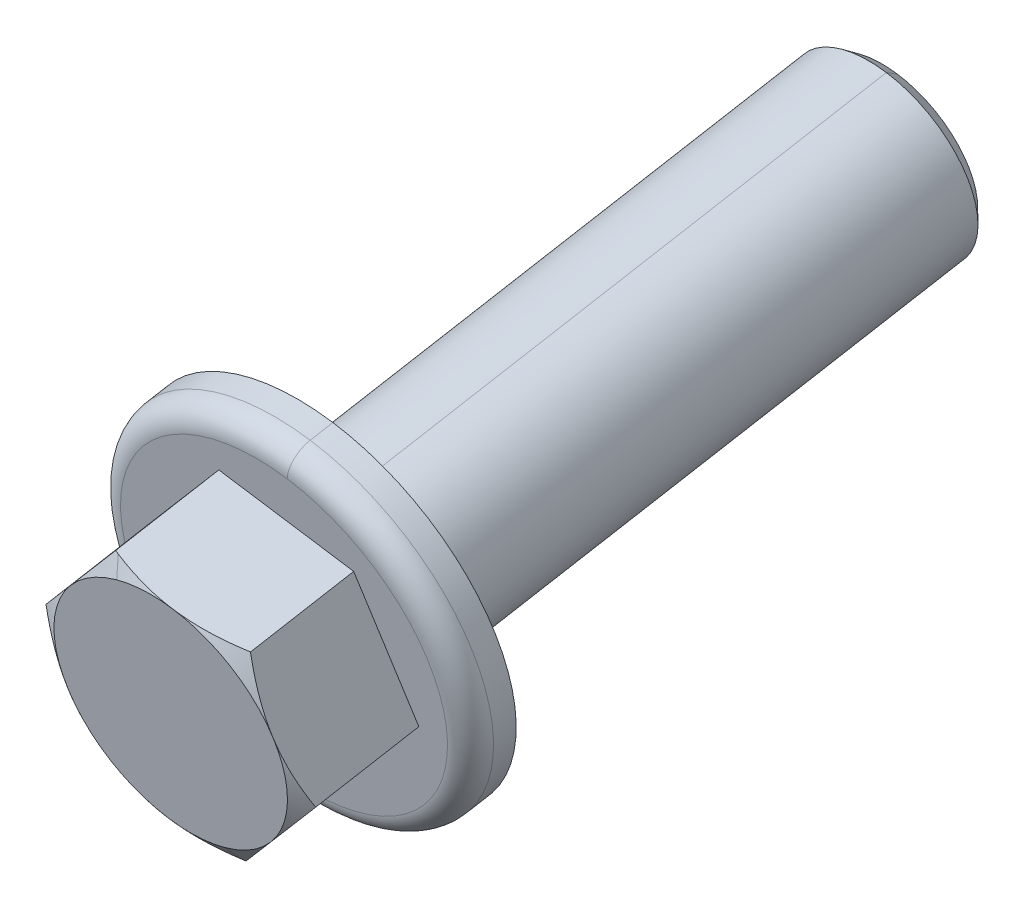
ISO-10303-21;
HEADER;
FILE_DESCRIPTION(('STEP AP214'),'2;1');
FILE_NAME('part.step','',(''),(''),'','','');
FILE_SCHEMA(('AUTOMOTIVE_DESIGN { 1 0 10303 214 1 1 1 1 }'));
ENDSEC;
DATA;
#1=APPLICATION_CONTEXT('core data for automotive mechanical design processes');
#2=APPLICATION_PROTOCOL_DEFINITION('international standard','automotive_design',2000,#1);
#3=PRODUCT_CONTEXT('',#1,'mechanical');
#4=PRODUCT('Part','Part','',(#3));
#5=PRODUCT_RELATED_PRODUCT_CATEGORY('part','',(#4));
#6=PRODUCT_DEFINITION_FORMATION('','',#4);
#7=PRODUCT_DEFINITION_CONTEXT('part definition',#1,'design');
#8=PRODUCT_DEFINITION('design','',#6,#7);
#9=PRODUCT_DEFINITION_SHAPE('','',#8);
#10=(LENGTH_UNIT() NAMED_UNIT(*) SI_UNIT(.MILLI.,.METRE.));
#11=(NAMED_UNIT(*) PLANE_ANGLE_UNIT() SI_UNIT($,.RADIAN.));
#12=(NAMED_UNIT(*) SI_UNIT($,.STERADIAN.) SOLID_ANGLE_UNIT());
#13=UNCERTAINTY_MEASURE_WITH_UNIT(LENGTH_MEASURE(1.E-05),#10,'distance_accuracy_value','');
#14=(GEOMETRIC_REPRESENTATION_CONTEXT(3) GLOBAL_UNCERTAINTY_ASSIGNED_CONTEXT((#13)) GLOBAL_UNIT_ASSIGNED_CONTEXT((#10,
#11,#12)) REPRESENTATION_CONTEXT('',''));
#15=CARTESIAN_POINT('',(0.,0.,0.));
#16=DIRECTION('',(0.,0.,1.));
#17=DIRECTION('',(1.,0.,0.));
#18=AXIS2_PLACEMENT_3D('',#15,#16,#17);
#19=CARTESIAN_POINT('',(50.8182230138327,136.292512906333,22.8581244768172));
#20=DIRECTION('',(0.,-0.173648177667837,0.984807753012048));
#21=DIRECTION('',(-0.981823816584318,0.186911201339512,0.0329574877929656));
#22=AXIS2_PLACEMENT_3D('',#19,#20,#21);
#23=TOROIDAL_SURFACE('',#22,4.25,0.25);
#24=CARTESIAN_POINT('',(50.8182230138327,136.249100861916,23.1043264150702));
#25=DIRECTION('',(0.,0.173648177667837,-0.984807753012048));
#26=DIRECTION('',(0.981823816584318,-0.186911201339512,-0.0329574877929656));
#27=AXIS2_PLACEMENT_3D('',#24,#25,#26);
#28=CIRCLE('',#27,4.25);
#29=CARTESIAN_POINT('',(51.6248500974065,140.358458615238,23.8289170603684));
#30=VERTEX_POINT('',#29);
#31=CARTESIAN_POINT('',(50.011595930259,132.139743108593,22.379735769772));
#32=VERTEX_POINT('',#31);
#33=EDGE_CURVE('E11',#30,#32,#28,.T.);
#34=ORIENTED_EDGE('',*,*,#33,.T.);
#35=CARTESIAN_POINT('',(50.011595930259,132.18315515301,22.133533831519));
#36=DIRECTION('',(-0.981823816584318,0.186911201339513,0.0329574877929657));
#37=DIRECTION('',(0.,-0.173648177667851,0.984807753012046));
#38=AXIS2_PLACEMENT_3D('',#35,#36,#37);
#39=CIRCLE('',#38,0.25);
#40=CARTESIAN_POINT('',(50.0590445822339,132.424882079676,22.1761568106542));
#41=VERTEX_POINT('',#40);
#42=EDGE_CURVE('E33',#32,#41,#39,.T.);
#43=ORIENTED_EDGE('',*,*,#42,.T.);
#44=CARTESIAN_POINT('',(50.8182230138327,136.292512906333,22.8581244768172));
#45=DIRECTION('',(0.,0.173648177667837,-0.984807753012048));
#46=DIRECTION('',(0.981823816584318,-0.186911201339512,-0.0329574877929656));
#47=AXIS2_PLACEMENT_3D('',#44,#45,#46);
#48=CIRCLE('',#47,4.);
#49=CARTESIAN_POINT('',(51.5774014454315,140.160143732989,23.5400921429802));
#50=VERTEX_POINT('',#49);
#51=EDGE_CURVE('E461',#50,#41,#48,.T.);
#52=ORIENTED_EDGE('',*,*,#51,.F.);
#53=CARTESIAN_POINT('',(51.6248500974065,140.401870659655,23.5827151221153));
#54=DIRECTION('',(0.981823816584318,-0.186911201339512,-0.0329574877929657));
#55=DIRECTION('',(0.,-0.173648177667851,0.984807753012046));
#56=AXIS2_PLACEMENT_3D('',#53,#54,#55);
#57=CIRCLE('',#56,0.25);
#58=EDGE_CURVE('E457',#30,#50,#57,.T.);
#59=ORIENTED_EDGE('',*,*,#58,.F.);
#60=EDGE_LOOP('',(#34,#43,#52,#59));
#61=FACE_BOUND('',#60,.T.);
#62=ADVANCED_FACE('F17',(#61),#23,.F.);
#63=CARTESIAN_POINT('',(50.8182230138327,136.292512906333,22.8581244768172));
#64=DIRECTION('',(0.,-0.173648177667837,0.984807753012048));
#65=DIRECTION('',(-0.189794607899707,-0.966907706664115,-0.170491916540747));
#66=AXIS2_PLACEMENT_3D('',#63,#64,#65);
#67=TOROIDAL_SURFACE('',#66,4.25,0.25);
#68=CARTESIAN_POINT('',(50.8182230138327,136.249100861916,23.1043264150702));
#69=DIRECTION('',(0.,0.173648177667837,-0.984807753012048));
#70=DIRECTION('',(0.981823816584318,-0.186911201339512,-0.0329574877929656));
#71=AXIS2_PLACEMENT_3D('',#68,#69,#70);
#72=CIRCLE('',#71,4.25);
#73=EDGE_CURVE('E454',#32,#30,#72,.T.);
#74=ORIENTED_EDGE('',*,*,#73,.T.);
#75=ORIENTED_EDGE('',*,*,#58,.T.);
#76=CARTESIAN_POINT('',(50.8182230138327,136.292512906333,22.8581244768172));
#77=DIRECTION('',(0.,0.173648177667837,-0.984807753012048));
#78=DIRECTION('',(0.981823816584318,-0.186911201339512,-0.0329574877929656));
#79=AXIS2_PLACEMENT_3D('',#76,#77,#78);
#80=CIRCLE('',#79,4.);
#81=EDGE_CURVE('E465',#41,#50,#80,.T.);
#82=ORIENTED_EDGE('',*,*,#81,.F.);
#83=ORIENTED_EDGE('',*,*,#42,.F.);
#84=EDGE_LOOP('',(#74,#75,#82,#83));
#85=FACE_BOUND('',#84,.T.);
#86=ADVANCED_FACE('F311',(#85),#67,.F.);
#87=CARTESIAN_POINT('',(50.8182230138327,138.419703082764,10.7942295024196));
#88=DIRECTION('',(0.,-0.173648177667837,0.984807753012048));
#89=DIRECTION('',(-0.981823816584318,0.186911201339512,0.0329574877929656));
#90=AXIS2_PLACEMENT_3D('',#87,#88,#89);
#91=CYLINDRICAL_SURFACE('',#90,4.);
#92=DIRECTION('',(0.,0.173648177667837,-0.984807753012048));
#93=VECTOR('',#92,1.);
#94=CARTESIAN_POINT('',(51.5774014454315,142.28733390942,11.4761971685826));
#95=LINE('',#94,#93);
#96=CARTESIAN_POINT('',(51.5774014454315,144.371112041434,-0.341495867562001));
#97=VERTEX_POINT('',#96);
#98=EDGE_CURVE('E468',#50,#97,#95,.T.);
#99=ORIENTED_EDGE('',*,*,#98,.F.);
#100=ORIENTED_EDGE('',*,*,#51,.T.);
#101=DIRECTION('',(0.,0.173648177667837,-0.984807753012048));
#102=VECTOR('',#101,1.);
#103=CARTESIAN_POINT('',(50.0590445822339,134.552072256107,10.1122618362566));
#104=LINE('',#103,#102);
#105=CARTESIAN_POINT('',(50.0590445822339,136.635850388121,-1.70543119988798));
#106=VERTEX_POINT('',#105);
#107=EDGE_CURVE('E472',#41,#106,#104,.T.);
#108=ORIENTED_EDGE('',*,*,#107,.T.);
#109=CARTESIAN_POINT('',(50.8182230138327,140.503481214778,-1.02346353372499));
#110=DIRECTION('',(0.,-0.173648177667837,0.984807753012048));
#111=DIRECTION('',(0.981823816584318,-0.186911201339512,-0.0329574877929656));
#112=AXIS2_PLACEMENT_3D('',#109,#110,#111);
#113=CIRCLE('',#112,4.);
#114=EDGE_CURVE('E467',#106,#97,#113,.T.);
#115=ORIENTED_EDGE('',*,*,#114,.T.);
#116=EDGE_LOOP('',(#99,#100,#108,#115));
#117=FACE_BOUND('',#116,.T.);
#118=ADVANCED_FACE('F317',(#117),#91,.T.);
#119=CARTESIAN_POINT('',(50.8182230138327,138.419703082764,10.7942295024196));
#120=DIRECTION('',(0.,-0.173648177667837,0.984807753012048));
#121=DIRECTION('',(-0.981823816584318,0.186911201339512,0.0329574877929656));
#122=AXIS2_PLACEMENT_3D('',#119,#120,#121);
#123=CYLINDRICAL_SURFACE('',#122,4.);
#124=ORIENTED_EDGE('',*,*,#107,.F.);
#125=ORIENTED_EDGE('',*,*,#81,.T.);
#126=ORIENTED_EDGE('',*,*,#98,.T.);
#127=CARTESIAN_POINT('',(50.8182230138327,140.503481214778,-1.02346353372499));
#128=DIRECTION('',(0.,-0.173648177667837,0.984807753012048));
#129=DIRECTION('',(0.981823816584318,-0.186911201339512,-0.0329574877929656));
#130=AXIS2_PLACEMENT_3D('',#127,#128,#129);
#131=CIRCLE('',#130,4.);
#132=EDGE_CURVE('E471',#97,#106,#131,.T.);
#133=ORIENTED_EDGE('',*,*,#132,.T.);
#134=EDGE_LOOP('',(#124,#125,#126,#133));
#135=FACE_BOUND('',#134,.T.);
#136=ADVANCED_FACE('F322',(#135),#123,.T.);
#137=CARTESIAN_POINT('',(50.8182230138326,141.198073925449,-4.96269454577318));
#138=DIRECTION('',(0.,-0.173648177667841,0.984807753012047));
#139=DIRECTION('',(-0.451846987264252,-0.878542520107084,-0.154910749995318));
#140=AXIS2_PLACEMENT_3D('',#137,#138,#139);
#141=CONICAL_SURFACE('',#140,0.,0.785398163396999);
#142=DIRECTION('',(0.13420522229565,0.806494768147671,-0.575808255636379));
#143=VECTOR('',#142,1.);
#144=CARTESIAN_POINT('',(50.1064923431634,136.920989528834,-1.90901012909553));
#145=LINE('',#144,#143);
#146=CARTESIAN_POINT('',(50.1539416289527,137.206128379257,-2.112589109489));
#147=VERTEX_POINT('',#146);
#148=EDGE_CURVE('E478',#106,#147,#145,.T.);
#149=ORIENTED_EDGE('',*,*,#148,.T.);
#150=CARTESIAN_POINT('',(50.8182230138327,140.590305303612,-1.51586741023105));
#151=DIRECTION('',(0.,-0.173648177667845,0.984807753012047));
#152=DIRECTION('',(-0.89209545459018,0.444982416232706,0.0784624059231102));
#153=AXIS2_PLACEMENT_3D('',#150,#151,#152);
#154=CIRCLE('',#153,3.5);
#155=CARTESIAN_POINT('',(51.4825041414817,143.974482276936,-0.919145702338399));
#156=VERTEX_POINT('',#155);
#157=EDGE_CURVE('E481',#147,#156,#154,.T.);
#158=ORIENTED_EDGE('',*,*,#157,.T.);
#159=DIRECTION('',(-0.134205054278539,-0.560919192194113,-0.816920230643359));
#160=VECTOR('',#159,1.);
#161=CARTESIAN_POINT('',(51.5299527934566,144.172797159185,-0.6303207849502));
#162=LINE('',#161,#160);
#163=EDGE_CURVE('E484',#97,#156,#162,.T.);
#164=ORIENTED_EDGE('',*,*,#163,.F.);
#165=ORIENTED_EDGE('',*,*,#114,.F.);
#166=EDGE_LOOP('',(#149,#158,#164,#165));
#167=FACE_BOUND('',#166,.T.);
#168=ADVANCED_FACE('F326',(#167),#141,.T.);
#169=CARTESIAN_POINT('',(50.8182230138314,141.198073925449,-4.96269454577328));
#170=DIRECTION('',(3.37838830481801E-13,-0.173648177667704,0.984807753012072));
#171=DIRECTION('',(0.189794607899706,0.96690770666415,0.170491916540554));
#172=AXIS2_PLACEMENT_3D('',#169,#170,#171);
#173=CONICAL_SURFACE('',#172,0.,0.785398163396999);
#174=ORIENTED_EDGE('',*,*,#163,.T.);
#175=CARTESIAN_POINT('',(50.8182230138325,140.590305303612,-1.51586741023031));
#176=DIRECTION('',(3.00415963051425E-13,-0.173648177667894,0.984807753012038));
#177=DIRECTION('',(-0.981823816584319,0.186911201339457,0.0329574877932666));
#178=AXIS2_PLACEMENT_3D('',#175,#176,#177);
#179=CIRCLE('',#178,3.5);
#180=EDGE_CURVE('E352',#156,#147,#179,.T.);
#181=ORIENTED_EDGE('',*,*,#180,.T.);
#182=ORIENTED_EDGE('',*,*,#148,.F.);
#183=ORIENTED_EDGE('',*,*,#132,.F.);
#184=EDGE_LOOP('',(#174,#181,#182,#183));
#185=FACE_BOUND('',#184,.T.);
#186=ADVANCED_FACE('F330',(#185),#173,.T.);
#187=CARTESIAN_POINT('',(50.8182230138327,140.590305303612,-1.51586741023102));
#188=DIRECTION('',(0.,-0.173648177667837,0.984807753012048));
#189=DIRECTION('',(-0.189794607899706,-0.966907706664116,-0.170491916540747));
#190=AXIS2_PLACEMENT_3D('',#187,#188,#189);
#191=PLANE('',#190);
#192=ORIENTED_EDGE('',*,*,#180,.F.);
#193=ORIENTED_EDGE('',*,*,#157,.F.);
#194=EDGE_LOOP('',(#192,#193));
#195=FACE_BOUND('',#194,.T.);
#196=ADVANCED_FACE('F334',(#195),#191,.F.);
#197=CARTESIAN_POINT('',(50.8182230138327,135.033563618241,29.9979806861545));
#198=DIRECTION('',(0.,-0.173648177667837,0.984807753012048));
#199=DIRECTION('',(-0.981823816584318,0.186911201339512,0.0329574877929656));
#200=AXIS2_PLACEMENT_3D('',#197,#198,#199);
#201=PLANE('',#200);
#202=CARTESIAN_POINT('',(50.8182230138327,135.033563618241,29.9979806861545));
#203=DIRECTION('',(0.,-0.173648177667837,0.984807753012048));
#204=DIRECTION('',(0.981823816584318,-0.186911201339512,-0.0329574877929656));
#205=AXIS2_PLACEMENT_3D('',#202,#203,#204);
#206=CIRCLE('',#205,5.);
#207=CARTESIAN_POINT('',(47.0412876975687,138.260182127962,30.5669205858742));
#208=VERTEX_POINT('',#207);
#209=CARTESIAN_POINT('',(46.0923146580695,133.425643594639,29.7144610031698));
#210=VERTEX_POINT('',#209);
#211=EDGE_CURVE('E347',#208,#210,#206,.T.);
#212=ORIENTED_EDGE('',*,*,#211,.T.);
#213=CARTESIAN_POINT('',(50.8182230138327,135.033563618241,29.9979806861545));
#214=DIRECTION('',(0.,-0.173648177667837,0.984807753012048));
#215=DIRECTION('',(0.981823816584318,-0.186911201339512,-0.0329574877929656));
#216=AXIS2_PLACEMENT_3D('',#213,#214,#215);
#217=CIRCLE('',#216,5.);
#218=CARTESIAN_POINT('',(49.8692499743343,130.19902508492,29.1455211034506));
#219=VERTEX_POINT('',#218);
#220=EDGE_CURVE('E353',#210,#219,#217,.T.);
#221=ORIENTED_EDGE('',*,*,#220,.T.);
#222=CARTESIAN_POINT('',(50.8182230138327,135.033563618241,29.9979806861545));
#223=DIRECTION('',(0.,-0.173648177667837,0.984807753012048));
#224=DIRECTION('',(0.981823816584318,-0.186911201339512,-0.0329574877929656));
#225=AXIS2_PLACEMENT_3D('',#222,#223,#224);
#226=CIRCLE('',#225,5.);
#227=CARTESIAN_POINT('',(52.3389778830659,130.342806889747,29.1708737149768));
#228=VERTEX_POINT('',#227);
#229=EDGE_CURVE('E368',#219,#228,#226,.T.);
#230=ORIENTED_EDGE('',*,*,#229,.T.);
#231=CARTESIAN_POINT('',(50.8182230138327,135.033563618241,29.9979806861545));
#232=DIRECTION('',(0.,-0.173648177667837,0.984807753012048));
#233=DIRECTION('',(0.981823816584318,-0.186911201339512,-0.0329574877929656));
#234=AXIS2_PLACEMENT_3D('',#231,#232,#233);
#235=CIRCLE('',#234,5.);
#236=CARTESIAN_POINT('',(54.5951583300968,131.80694510852,29.4290407864335));
#237=VERTEX_POINT('',#236);
#238=EDGE_CURVE('E372',#228,#237,#235,.T.);
#239=ORIENTED_EDGE('',*,*,#238,.T.);
#240=CARTESIAN_POINT('',(50.8182230138327,135.033563618241,29.9979806861545));
#241=DIRECTION('',(0.,-0.173648177667837,0.984807753012048));
#242=DIRECTION('',(0.981823816584318,-0.186911201339512,-0.0329574877929656));
#243=AXIS2_PLACEMENT_3D('',#240,#241,#242);
#244=CIRCLE('',#243,5.);
#245=CARTESIAN_POINT('',(55.5441313695961,136.641483641843,30.2815003691377));
#246=VERTEX_POINT('',#245);
#247=EDGE_CURVE('E172',#237,#246,#244,.T.);
#248=ORIENTED_EDGE('',*,*,#247,.T.);
#249=CARTESIAN_POINT('',(50.8182230138327,135.033563618241,29.9979806861545));
#250=DIRECTION('',(0.,-0.173648177667837,0.984807753012048));
#251=DIRECTION('',(0.981823816584318,-0.186911201339512,-0.0329574877929656));
#252=AXIS2_PLACEMENT_3D('',#249,#250,#251);
#253=CIRCLE('',#252,5.);
#254=CARTESIAN_POINT('',(51.7671960533311,139.868102151561,30.8504402688583));
#255=VERTEX_POINT('',#254);
#256=EDGE_CURVE('E147',#246,#255,#253,.T.);
#257=ORIENTED_EDGE('',*,*,#256,.T.);
#258=CARTESIAN_POINT('',(50.8182230138327,135.033563618241,29.9979806861545));
#259=DIRECTION('',(0.,-0.173648177667837,0.984807753012048));
#260=DIRECTION('',(0.981823816584318,-0.186911201339512,-0.0329574877929656));
#261=AXIS2_PLACEMENT_3D('',#258,#259,#260);
#262=CIRCLE('',#261,5.);
#263=CARTESIAN_POINT('',(49.2974681445995,139.724320346735,30.8250876573322));
#264=VERTEX_POINT('',#263);
#265=EDGE_CURVE('E160',#255,#264,#262,.T.);
#266=ORIENTED_EDGE('',*,*,#265,.T.);
#267=CARTESIAN_POINT('',(50.8182230138327,135.033563618241,29.9979806861545));
#268=DIRECTION('',(0.,-0.173648177667837,0.984807753012048));
#269=DIRECTION('',(0.981823816584318,-0.186911201339512,-0.0329574877929656));
#270=AXIS2_PLACEMENT_3D('',#267,#268,#269);
#271=CIRCLE('',#270,5.);
#272=EDGE_CURVE('E166',#264,#208,#271,.T.);
#273=ORIENTED_EDGE('',*,*,#272,.T.);
#274=EDGE_LOOP('',(#212,#221,#230,#239,#248,#257,#266,#273));
#275=FACE_BOUND('',#274,.T.);
#276=ADVANCED_FACE('F169',(#275),#201,.T.);
#277=CARTESIAN_POINT('',(50.8182230138327,135.033563618241,29.9979806861545));
#278=DIRECTION('',(0.,0.173648177667837,-0.984807753012048));
#279=DIRECTION('',(-0.304150973846769,0.938151345699194,0.165421394235613));
#280=AXIS2_PLACEMENT_3D('',#277,#278,#279);
#281=CONICAL_SURFACE('',#280,5.,1.0471975512);
#282=ORIENTED_EDGE('',*,*,#211,.F.);
#283=CARTESIAN_POINT('',(45.1496605658112,136.190244090608,29.748463427114));
#284=CARTESIAN_POINT('',(45.3036382083612,136.353266523007,29.8461053717376));
#285=CARTESIAN_POINT('',(45.4588489592054,136.518676485707,29.9383930088207));
#286=CARTESIAN_POINT('',(45.7706386283176,136.853602703809,30.1087629861156));
#287=CARTESIAN_POINT('',(45.9272066710807,137.02309398833,30.1869147456619));
#288=CARTESIAN_POINT('',(46.1635363575673,137.281254874604,30.291697772944));
#289=CARTESIAN_POINT('',(46.2426114546965,137.368020600176,30.3245687859515));
#290=CARTESIAN_POINT('',(46.4011402136773,137.542790093847,30.3858026442966));
#291=CARTESIAN_POINT('',(46.4805938655093,137.630793829296,30.4141656082784));
#292=CARTESIAN_POINT('',(46.6401736231209,137.808411579275,30.4662233081588));
#293=CARTESIAN_POINT('',(46.7203011023484,137.898031459716,30.489893894514));
#294=CARTESIAN_POINT('',(46.8807136456035,138.078340485048,30.5322171015839));
#295=CARTESIAN_POINT('',(46.9609987376901,138.169029838127,30.5508687278757));
#296=CARTESIAN_POINT('',(47.041287697568,138.260182127963,30.5669205858737));
#297=B_SPLINE_CURVE_WITH_KNOTS('',3,(#283,#284,#285,#286,#287,#288,#289,#290,#291,#292,#293,
#294,#295,#296),.UNSPECIFIED.,.F.,.F.,(4,2,2,2,2,2,4),(0.,0.73403665839157,1.46436443241697,
1.83000749078367,2.19564092445852,2.56310985866721,2.93065154716805),.UNSPECIFIED.);
#298=CARTESIAN_POINT('',(45.1496605658112,136.190244090609,29.7484634271141));
#299=VERTEX_POINT('',#298);
#300=EDGE_CURVE('E218',#299,#208,#297,.T.);
#301=ORIENTED_EDGE('',*,*,#300,.F.);
#302=CARTESIAN_POINT('',(46.0923146580683,133.425643594639,29.714461003169));
#303=CARTESIAN_POINT('',(46.0523042800602,133.539690344198,29.7345912722321));
#304=CARTESIAN_POINT('',(46.0122958294876,133.654190145381,29.7521200299855));
#305=CARTESIAN_POINT('',(45.9323574855031,133.883856536756,29.7820865503086));
#306=CARTESIAN_POINT('',(45.8924275781086,133.999022990471,29.7945253199458));
#307=CARTESIAN_POINT('',(45.8129042359929,134.229252259792,29.8143820535698));
#308=CARTESIAN_POINT('',(45.7733101168418,134.344312719683,29.8218247860426));
#309=CARTESIAN_POINT('',(45.6943105186203,134.574704148621,29.8320317298825));
#310=CARTESIAN_POINT('',(45.654905044543,134.690035124708,29.83479581809));
#311=CARTESIAN_POINT('',(45.5371349288852,135.035875395273,29.8365144911382));
#312=CARTESIAN_POINT('',(45.4591124139035,135.266533919939,29.8289199392774));
#313=CARTESIAN_POINT('',(45.3037383433069,135.72846620757,29.799057616351));
#314=CARTESIAN_POINT('',(45.2263922072797,135.959737146273,29.7767155249173));
#315=CARTESIAN_POINT('',(45.1496605658113,136.190244090611,29.7484634271142));
#316=B_SPLINE_CURVE_WITH_KNOTS('',3,(#302,#303,#304,#305,#306,#307,#308,#309,#310,#311,#312,
#313,#314,#315),.UNSPECIFIED.,.F.,.F.,(4,2,2,2,2,2,4),(0.,0.367541688500815,0.735010622709433,
1.1006440563843,1.46628711475101,2.19661488877635,2.93065154716788),.UNSPECIFIED.);
#317=EDGE_CURVE('E234',#210,#299,#316,.T.);
#318=ORIENTED_EDGE('',*,*,#317,.F.);
#319=EDGE_LOOP('',(#282,#301,#318));
#320=FACE_BOUND('',#319,.T.);
#321=ADVANCED_FACE('F248',(#320),#281,.T.);
#322=CARTESIAN_POINT('',(50.8182230138327,135.033563618241,29.9979806861545));
#323=DIRECTION('',(0.,0.173648177667837,-0.984807753012048));
#324=DIRECTION('',(-0.304150973846769,0.938151345699194,0.165421394235613));
#325=AXIS2_PLACEMENT_3D('',#322,#323,#324);
#326=CONICAL_SURFACE('',#325,5.,1.0471975512);
#327=ORIENTED_EDGE('',*,*,#220,.F.);
#328=CARTESIAN_POINT('',(47.0349687503238,130.816139395247,28.8008637721658));
#329=CARTESIAN_POINT('',(46.9582371088555,131.023082283341,28.9062500781332));
#330=CARTESIAN_POINT('',(46.8808909728285,131.232764432527,29.0063440961886));
#331=CARTESIAN_POINT('',(46.7255169022321,131.656625278549,29.1923956479049));
#332=CARTESIAN_POINT('',(46.6474943872506,131.870775902383,29.2784220539125));
#333=CARTESIAN_POINT('',(46.5297242715929,132.196347273404,29.3950913684381));
#334=CARTESIAN_POINT('',(46.4903187975156,132.305668314426,29.4319394921177));
#335=CARTESIAN_POINT('',(46.4113191992942,132.525656420486,29.5011466118572));
#336=CARTESIAN_POINT('',(46.3717250801432,132.636323450017,29.5335057260572));
#337=CARTESIAN_POINT('',(46.2922017380277,132.859459598366,29.5935895476891));
#338=CARTESIAN_POINT('',(46.2522718306333,132.971934974858,29.6212901746556));
#339=CARTESIAN_POINT('',(46.1723334866489,133.197999941651,29.6716813887327));
#340=CARTESIAN_POINT('',(46.1323250360764,133.311589748143,29.6943709828318));
#341=CARTESIAN_POINT('',(46.0923146580683,133.425643594639,29.714461003169));
#342=B_SPLINE_CURVE_WITH_KNOTS('',3,(#328,#329,#330,#331,#332,#333,#334,#335,#336,#337,#338,
#339,#340,#341),.UNSPECIFIED.,.F.,.F.,(4,2,2,2,2,2,4),(0.,0.734036658390363,1.46436443241452,
1.8300074907806,2.19564092445491,2.56310985866291,2.93065154716313),.UNSPECIFIED.);
#343=CARTESIAN_POINT('',(47.0349687503229,130.816139395248,28.800863772166));
#344=VERTEX_POINT('',#343);
#345=EDGE_CURVE('E225',#344,#210,#342,.T.);
#346=ORIENTED_EDGE('',*,*,#345,.F.);
#347=CARTESIAN_POINT('',(49.8692499743342,130.19902508492,29.1455211034505));
#348=CARTESIAN_POINT('',(49.7489506364481,130.221923093111,29.1495793901527));
#349=CARTESIAN_POINT('',(49.6286570937891,130.24527854387,29.1510369397872));
#350=CARTESIAN_POINT('',(49.3883062065496,130.292835197622,29.1488925999175));
#351=CARTESIAN_POINT('',(49.2682488199277,130.317036232285,29.1452917118642));
#352=CARTESIAN_POINT('',(49.0291457202006,130.366101191142,29.1332042896118));
#353=CARTESIAN_POINT('',(48.9100979492176,130.390961200403,29.1247422489664));
#354=CARTESIAN_POINT('',(48.6725695920153,130.441381474232,29.103215422411));
#355=CARTESIAN_POINT('',(48.5540890208088,130.466941757214,29.0901505153472));
#356=CARTESIAN_POINT('',(48.1999892186646,130.544486691733,29.0445614818521));
#357=CARTESIAN_POINT('',(47.96539866092,130.597399981463,29.0056256493794));
#358=CARTESIAN_POINT('',(47.4982349212116,130.705370330188,28.9133502864795));
#359=CARTESIAN_POINT('',(47.2656780343403,130.760436911432,28.8599386127075));
#360=CARTESIAN_POINT('',(47.034968750322,130.816139395249,28.8008637721661));
#361=B_SPLINE_CURVE_WITH_KNOTS('',3,(#347,#348,#349,#350,#351,#352,#353,#354,#355,#356,#357,
#358,#359,#360),.UNSPECIFIED.,.F.,.F.,(4,2,2,2,2,2,4),(0.,0.367541688500749,0.735010622709314,
1.10064405638412,1.46628711475074,2.19661488877595,2.93065154716738),.UNSPECIFIED.);
#362=EDGE_CURVE('E256',#219,#344,#361,.T.);
#363=ORIENTED_EDGE('',*,*,#362,.F.);
#364=EDGE_LOOP('',(#327,#346,#363));
#365=FACE_BOUND('',#364,.T.);
#366=ADVANCED_FACE('F243',(#365),#326,.T.);
#367=CARTESIAN_POINT('',(50.8182230138327,135.033563618241,29.9979806861545));
#368=DIRECTION('',(0.,0.173648177667837,-0.984807753012048));
#369=DIRECTION('',(-0.304150973846769,0.938151345699194,0.165421394235613));
#370=AXIS2_PLACEMENT_3D('',#367,#368,#369);
#371=CONICAL_SURFACE('',#370,5.,1.0471975512);
#372=DIRECTION('',(-0.26340246993695,0.725638809136051,0.635663006243661));
#373=VECTOR('',#372,1.);
#374=CARTESIAN_POINT('',(53.0175439241827,128.473447600464,27.5333061943536));
#375=LINE('',#374,#373);
#376=CARTESIAN_POINT('',(52.5511139522763,129.758400203383,28.6589307118888));
#377=VERTEX_POINT('',#376);
#378=EDGE_CURVE('E359',#377,#228,#375,.T.);
#379=ORIENTED_EDGE('',*,*,#378,.T.);
#380=ORIENTED_EDGE('',*,*,#229,.F.);
#381=CARTESIAN_POINT('',(52.5511139522768,129.758400203378,28.6589307118755));
#382=CARTESIAN_POINT('',(52.3324329682307,129.789320498255,28.727012533312));
#383=CARTESIAN_POINT('',(52.11209454109,129.821490911837,28.7898496741226));
#384=CARTESIAN_POINT('',(51.6696011530065,129.888531349323,28.9022359022549));
#385=CARTESIAN_POINT('',(51.4474594494762,129.923388088566,28.9518455722481));
#386=CARTESIAN_POINT('',(51.112348605389,129.978078965806,29.0147294953495));
#387=CARTESIAN_POINT('',(51.0002659976719,129.996721213683,29.0337763892331));
#388=CARTESIAN_POINT('',(50.7756153262999,130.034827513887,29.0677499104704));
#389=CARTESIAN_POINT('',(50.6630472718857,130.054291550633,29.0826766159054));
#390=CARTESIAN_POINT('',(50.437041771263,130.09414565985,29.1082460394783));
#391=CARTESIAN_POINT('',(50.3236027139623,130.114539607262,29.1188685752324));
#392=CARTESIAN_POINT('',(50.0965272515829,130.156160851112,29.13560718058));
#393=CARTESIAN_POINT('',(49.982890818115,130.177388278917,29.1417225367649));
#394=CARTESIAN_POINT('',(49.8692499743342,130.19902508492,29.1455211034505));
#395=B_SPLINE_CURVE_WITH_KNOTS('',3,(#381,#382,#383,#384,#385,#386,#387,#388,#389,#390,#391,
#392,#393,#394),.UNSPECIFIED.,.F.,.F.,(4,2,2,2,2,2,4),(0.,0.693572709725049,1.38391201165243,
1.72946469135571,2.07501082206932,2.42215898329287,2.7693620802706),.UNSPECIFIED.);
#396=EDGE_CURVE('E262',#377,#219,#395,.T.);
#397=ORIENTED_EDGE('',*,*,#396,.F.);
#398=EDGE_LOOP('',(#379,#380,#397));
#399=FACE_BOUND('',#398,.T.);
#400=ADVANCED_FACE('F247',(#399),#371,.T.);
#401=CARTESIAN_POINT('',(50.8182230138327,135.033563618241,29.9979806861545));
#402=DIRECTION('',(0.,0.173648177667837,-0.984807753012048));
#403=DIRECTION('',(-0.304150973846769,0.938151345699194,0.165421394235613));
#404=AXIS2_PLACEMENT_3D('',#401,#402,#403);
#405=CONICAL_SURFACE('',#404,5.,1.0471975512);
#406=ORIENTED_EDGE('',*,*,#238,.F.);
#407=ORIENTED_EDGE('',*,*,#378,.F.);
#408=CARTESIAN_POINT('',(52.5511139522749,129.758400203394,28.6589307118272));
#409=CARTESIAN_POINT('',(52.6012609583614,129.751308593787,28.6433246970105));
#410=CARTESIAN_POINT('',(52.6520487756004,129.744179371395,28.6272186326257));
#411=CARTESIAN_POINT('',(52.7035311983447,129.737007071172,28.6105836276583));
#412=B_SPLINE_CURVE_WITH_KNOTS('',3,(#408,#409,#410,#411),.UNSPECIFIED.,.F.,.F.,(4,4),(0.,1.),.UNSPECIFIED.);
#413=CARTESIAN_POINT('',(52.7035311983433,129.737007071169,28.610583627666));
#414=VERTEX_POINT('',#413);
#415=EDGE_CURVE('E362',#377,#414,#412,.T.);
#416=ORIENTED_EDGE('',*,*,#415,.T.);
#417=CARTESIAN_POINT('',(54.5951583300977,131.806945108519,29.4290407864327));
#418=CARTESIAN_POINT('',(54.5148693702198,131.715792818683,29.4129889284348));
#419=CARTESIAN_POINT('',(54.4345842781332,131.625103465604,29.3943373021429));
#420=CARTESIAN_POINT('',(54.2741717348782,131.444794440272,29.3520140950731));
#421=CARTESIAN_POINT('',(54.1940442556508,131.355174559831,29.3283435087179));
#422=CARTESIAN_POINT('',(54.0344644980393,131.177556809853,29.2762858088376));
#423=CARTESIAN_POINT('',(53.9550108462073,131.089553074403,29.2479228448558));
#424=CARTESIAN_POINT('',(53.7964820872266,130.914783580733,29.1866889865107));
#425=CARTESIAN_POINT('',(53.7174069900974,130.828017855161,29.1538179735033));
#426=CARTESIAN_POINT('',(53.481077303611,130.569856968887,29.0490349462213));
#427=CARTESIAN_POINT('',(53.324509260848,130.400365684366,28.9708831866751));
#428=CARTESIAN_POINT('',(53.012719591736,130.065439466265,28.8005132093803));
#429=CARTESIAN_POINT('',(52.8575088408919,129.900029503565,28.7082255722973));
#430=CARTESIAN_POINT('',(52.703531198342,129.737007071165,28.6105836276738));
#431=B_SPLINE_CURVE_WITH_KNOTS('',3,(#417,#418,#419,#420,#421,#422,#423,#424,#425,#426,#427,
#428,#429,#430),.UNSPECIFIED.,.F.,.F.,(4,2,2,2,2,2,4),(0.,0.367541688500594,0.735010622709003,
1.10064405638367,1.46628711475015,2.19661488877513,2.93065154716625),.UNSPECIFIED.);
#432=EDGE_CURVE('E287',#237,#414,#431,.T.);
#433=ORIENTED_EDGE('',*,*,#432,.F.);
#434=EDGE_LOOP('',(#406,#407,#416,#433));
#435=FACE_BOUND('',#434,.T.);
#436=ADVANCED_FACE('F297',(#435),#405,.T.);
#437=CARTESIAN_POINT('',(50.8182230138327,135.033563618241,29.9979806861545));
#438=DIRECTION('',(0.,0.173648177667837,-0.984807753012048));
#439=DIRECTION('',(-0.304150973846769,0.938151345699194,0.165421394235613));
#440=AXIS2_PLACEMENT_3D('',#437,#438,#439);
#441=CONICAL_SURFACE('',#440,5.,1.0471975512);
#442=ORIENTED_EDGE('',*,*,#247,.F.);
#443=CARTESIAN_POINT('',(56.4867854618543,134.03197944245,29.3679031381323));
#444=CARTESIAN_POINT('',(56.3328078193043,133.845392953807,29.4038995972795));
#445=CARTESIAN_POINT('',(56.1775970684601,133.658394201591,29.4340480696857));
#446=CARTESIAN_POINT('',(55.865807399348,133.28539654188,29.4795919670339));
#447=CARTESIAN_POINT('',(55.7092393565849,133.099397356528,29.4950611653563));
#448=CARTESIAN_POINT('',(55.4729096700983,132.820967570711,29.5052287795518));
#449=CARTESIAN_POINT('',(55.3938345729691,132.728191910074,29.5064418020166));
#450=CARTESIAN_POINT('',(55.2353058139883,132.543019093526,29.5042081195713));
#451=CARTESIAN_POINT('',(55.1558521621563,132.450621927716,29.5007615373167));
#452=CARTESIAN_POINT('',(54.9962724045447,132.265911056766,29.4889309254443));
#453=CARTESIAN_POINT('',(54.9161449253173,132.173600099102,29.4805221964185));
#454=CARTESIAN_POINT('',(54.7557323820622,131.989689649189,29.4586236831028));
#455=CARTESIAN_POINT('',(54.6754472899757,131.898090301419,29.4451328931566));
#456=CARTESIAN_POINT('',(54.5951583300977,131.806945108519,29.4290407864327));
#457=B_SPLINE_CURVE_WITH_KNOTS('',3,(#443,#444,#445,#446,#447,#448,#449,#450,#451,#452,#453,
#454,#455,#456),.UNSPECIFIED.,.F.,.F.,(4,2,2,2,2,2,4),(0.,0.734036658391473,1.46436443241678,
1.83000749078348,2.19564092445831,2.56310985866687,2.93065154716762),.UNSPECIFIED.);
#458=CARTESIAN_POINT('',(56.4867854618543,134.031979442449,29.367903138132));
#459=VERTEX_POINT('',#458);
#460=EDGE_CURVE('E268',#459,#237,#457,.T.);
#461=ORIENTED_EDGE('',*,*,#460,.F.);
#462=CARTESIAN_POINT('',(55.5441313695973,136.641483641844,30.281500369137));
#463=CARTESIAN_POINT('',(55.5841417476054,136.527429795348,30.2614103487998));
#464=CARTESIAN_POINT('',(55.624150198178,136.413839988856,30.2387207547007));
#465=CARTESIAN_POINT('',(55.7040885421625,136.187775022063,30.1883295406234));
#466=CARTESIAN_POINT('',(55.744018449557,136.07529964557,30.1606289136568));
#467=CARTESIAN_POINT('',(55.8235417916727,135.85216349722,30.1005450920249));
#468=CARTESIAN_POINT('',(55.8631359108238,135.741496467689,30.0681859778248));
#469=CARTESIAN_POINT('',(55.9421355090453,135.521508361629,29.9989788580851));
#470=CARTESIAN_POINT('',(55.9815409831226,135.412187320607,29.9621307344054));
#471=CARTESIAN_POINT('',(56.0993110987804,135.086615949585,29.8454614198795));
#472=CARTESIAN_POINT('',(56.1773336137621,134.872465325751,29.7594350138716));
#473=CARTESIAN_POINT('',(56.3327076843587,134.448604479729,29.573383462155));
#474=CARTESIAN_POINT('',(56.4100538203859,134.238922330542,29.4732894440993));
#475=CARTESIAN_POINT('',(56.4867854618543,134.031979442448,29.3679031381317));
#476=B_SPLINE_CURVE_WITH_KNOTS('',3,(#462,#463,#464,#465,#466,#467,#468,#469,#470,#471,#472,
#473,#474,#475),.UNSPECIFIED.,.F.,.F.,(4,2,2,2,2,2,4),(0.,0.36754168850079,0.73501062270944,
1.10064405638432,1.46628711475099,2.19661488877638,2.9306515471679),.UNSPECIFIED.);
#477=EDGE_CURVE('E188',#246,#459,#476,.T.);
#478=ORIENTED_EDGE('',*,*,#477,.F.);
#479=EDGE_LOOP('',(#442,#461,#478));
#480=FACE_BOUND('',#479,.T.);
#481=ADVANCED_FACE('F300',(#480),#441,.T.);
#482=CARTESIAN_POINT('',(50.8182230138327,135.033563618241,29.9979806861545));
#483=DIRECTION('',(0.,0.173648177667837,-0.984807753012048));
#484=DIRECTION('',(-0.304150973846769,0.938151345699194,0.165421394235613));
#485=AXIS2_PLACEMENT_3D('',#482,#483,#484);
#486=CONICAL_SURFACE('',#485,5.,1.0471975512);
#487=ORIENTED_EDGE('',*,*,#256,.F.);
#488=CARTESIAN_POINT('',(54.6014772773417,139.406084137811,30.3155027930828));
#489=CARTESIAN_POINT('',(54.67820891881,139.175577193474,30.3437548908859));
#490=CARTESIAN_POINT('',(54.7555550548371,138.944306254772,30.3660969823194));
#491=CARTESIAN_POINT('',(54.9109291254334,138.482373967141,30.3959593052456));
#492=CARTESIAN_POINT('',(54.988951640415,138.251715442475,30.4035538571063));
#493=CARTESIAN_POINT('',(55.1067217560726,137.905875171911,30.401835184058));
#494=CARTESIAN_POINT('',(55.1461272301499,137.790544195824,30.3990710958505));
#495=CARTESIAN_POINT('',(55.2251268283713,137.560152766887,30.3888641520106));
#496=CARTESIAN_POINT('',(55.2647209475224,137.445092306996,30.3814214195378));
#497=CARTESIAN_POINT('',(55.3442442896379,137.214863037675,30.3615646859138));
#498=CARTESIAN_POINT('',(55.3841741970323,137.09969658396,30.3491259162766));
#499=CARTESIAN_POINT('',(55.4641125410167,136.870030192585,30.3191593959535));
#500=CARTESIAN_POINT('',(55.5041209915892,136.755530391402,30.3016306382001));
#501=CARTESIAN_POINT('',(55.5441313695973,136.641483641844,30.281500369137));
#502=B_SPLINE_CURVE_WITH_KNOTS('',3,(#488,#489,#490,#491,#492,#493,#494,#495,#496,#497,#498,
#499,#500,#501),.UNSPECIFIED.,.F.,.F.,(4,2,2,2,2,2,4),(0.,0.734036658390432,1.46436443241466,
1.83000749078081,2.19564092445512,2.56310985866322,2.93065154716342),.UNSPECIFIED.);
#503=CARTESIAN_POINT('',(54.6014772773425,139.40608413781,30.3155027930828));
#504=VERTEX_POINT('',#503);
#505=EDGE_CURVE('E150',#504,#246,#502,.T.);
#506=ORIENTED_EDGE('',*,*,#505,.F.);
#507=CARTESIAN_POINT('',(51.767196053331,139.868102151561,30.8504402688584));
#508=CARTESIAN_POINT('',(51.8874953912171,139.845197046434,30.8464222308821));
#509=CARTESIAN_POINT('',(52.0077889338761,139.822751590366,30.8398038449021));
#510=CARTESIAN_POINT('',(52.2481398211156,139.778796361196,30.8215234910176));
#511=CARTESIAN_POINT('',(52.3681972077375,139.757286403756,30.8098625217415));
#512=CARTESIAN_POINT('',(52.6073003074646,139.71531456587,30.7817228559859));
#513=CARTESIAN_POINT('',(52.7263480784477,139.694847986968,30.765268514904));
#514=CARTESIAN_POINT('',(52.9638764356499,139.654831036018,30.7277951655596));
#515=CARTESIAN_POINT('',(53.0823570068564,139.6352806881,30.7067760371512));
#516=CARTESIAN_POINT('',(53.4364568090006,139.578004653124,30.6374144291687));
#517=CARTESIAN_POINT('',(53.6710473667452,139.541599264226,30.5827293037727));
#518=CARTESIAN_POINT('',(54.1382111064537,139.47170035711,30.4590907920294));
#519=CARTESIAN_POINT('',(54.370767993325,139.438222565382,30.3900663563122));
#520=CARTESIAN_POINT('',(54.6014772773433,139.406084137809,30.3155027930828));
#521=B_SPLINE_CURVE_WITH_KNOTS('',3,(#507,#508,#509,#510,#511,#512,#513,#514,#515,#516,#517,
#518,#519,#520),.UNSPECIFIED.,.F.,.F.,(4,2,2,2,2,2,4),(0.,0.367541688500755,0.735010622709323,
1.10064405638415,1.46628711475078,2.19661488877602,2.93065154716748),.UNSPECIFIED.);
#522=EDGE_CURVE('E21',#255,#504,#521,.T.);
#523=ORIENTED_EDGE('',*,*,#522,.F.);
#524=EDGE_LOOP('',(#487,#506,#523));
#525=FACE_BOUND('',#524,.T.);
#526=ADVANCED_FACE('F145',(#525),#486,.T.);
#527=CARTESIAN_POINT('',(50.8182230138327,135.033563618241,29.9979806861545));
#528=DIRECTION('',(0.,0.173648177667837,-0.984807753012048));
#529=DIRECTION('',(-0.304150973846769,0.938151345699194,0.165421394235613));
#530=AXIS2_PLACEMENT_3D('',#527,#528,#529);
#531=CONICAL_SURFACE('',#530,5.,1.0471975512);
#532=DIRECTION('',(0.26340246993695,-0.899286986803946,0.34914474676872));
#533=VECTOR('',#532,1.);
#534=CARTESIAN_POINT('',(48.6189021034827,142.041024554582,29.9256360742159));
#535=LINE('',#534,#533);
#536=CARTESIAN_POINT('',(49.085332075389,140.44857781674,30.5438974536996));
#537=VERTEX_POINT('',#536);
#538=EDGE_CURVE('E163',#537,#264,#535,.T.);
#539=ORIENTED_EDGE('',*,*,#538,.T.);
#540=ORIENTED_EDGE('',*,*,#265,.F.);
#541=CARTESIAN_POINT('',(49.0853320753883,140.448577816743,30.5438974536837));
#542=CARTESIAN_POINT('',(49.3040130594346,140.396236889493,30.5972980752152));
#543=CARTESIAN_POINT('',(49.5243514865754,140.344515021337,30.6453427432832));
#544=CARTESIAN_POINT('',(49.966844874659,140.243079263084,30.7280220725001));
#545=CARTESIAN_POINT('',(50.1889865781893,140.193357135991,30.7627182063601));
#546=CARTESIAN_POINT('',(50.5240974222765,140.120456953833,30.8031043831922));
#547=CARTESIAN_POINT('',(50.6361800299935,140.096424549692,30.8146265845328));
#548=CARTESIAN_POINT('',(50.8608307013655,140.048996711982,30.833518129484));
#549=CARTESIAN_POINT('',(50.9733987557796,140.025601266349,30.8408875517963));
#550=CARTESIAN_POINT('',(51.1994042564022,139.979405396094,30.8512840422989));
#551=CARTESIAN_POINT('',(51.3128433137029,139.956608233002,30.8542908199444));
#552=CARTESIAN_POINT('',(51.5399187760823,139.911772117087,30.8557846600845));
#553=CARTESIAN_POINT('',(51.6535552095502,139.889733284822,30.8542710072648));
#554=CARTESIAN_POINT('',(51.767196053331,139.868102151561,30.8504402688584));
#555=B_SPLINE_CURVE_WITH_KNOTS('',3,(#541,#542,#543,#544,#545,#546,#547,#548,#549,#550,#551,
#552,#553,#554),.UNSPECIFIED.,.F.,.F.,(4,2,2,2,2,2,4),(0.,0.693572709725159,1.38391201165253,
1.72946469135571,2.07501082206921,2.4221589832927,2.7693620802704),.UNSPECIFIED.);
#556=EDGE_CURVE('E155',#537,#255,#555,.T.);
#557=ORIENTED_EDGE('',*,*,#556,.F.);
#558=EDGE_LOOP('',(#539,#540,#557));
#559=FACE_BOUND('',#558,.T.);
#560=ADVANCED_FACE('F161',(#559),#531,.T.);
#561=CARTESIAN_POINT('',(50.8182230138327,135.033563618241,29.9979806861545));
#562=DIRECTION('',(0.,0.173648177667837,-0.984807753012048));
#563=DIRECTION('',(-0.304150973846769,0.938151345699194,0.165421394235613));
#564=AXIS2_PLACEMENT_3D('',#561,#562,#563);
#565=CONICAL_SURFACE('',#564,5.,1.0471975512);
#566=ORIENTED_EDGE('',*,*,#272,.F.);
#567=ORIENTED_EDGE('',*,*,#538,.F.);
#568=CARTESIAN_POINT('',(49.0853320753905,140.448577816751,30.5438974536377));
#569=CARTESIAN_POINT('',(49.035185069304,140.460579321392,30.5316580700089));
#570=CARTESIAN_POINT('',(48.984397252065,140.472787197516,30.5189616578212));
#571=CARTESIAN_POINT('',(48.9329148293207,140.485216461893,30.5057829375567));
#572=B_SPLINE_CURVE_WITH_KNOTS('',3,(#568,#569,#570,#571),.UNSPECIFIED.,.F.,.F.,(4,4),(0.,1.),.UNSPECIFIED.);
#573=CARTESIAN_POINT('',(48.9329148293223,140.485216461893,30.5057829375652));
#574=VERTEX_POINT('',#573);
#575=EDGE_CURVE('E178',#537,#574,#572,.T.);
#576=ORIENTED_EDGE('',*,*,#575,.T.);
#577=CARTESIAN_POINT('',(47.041287697568,138.260182127963,30.5669205858737));
#578=CARTESIAN_POINT('',(47.121576657446,138.351327320863,30.5830126925976));
#579=CARTESIAN_POINT('',(47.2018617495325,138.442926668633,30.5965034825438));
#580=CARTESIAN_POINT('',(47.3622742927876,138.626837118546,30.6184019958595));
#581=CARTESIAN_POINT('',(47.442401772015,138.71914807621,30.6268107248853));
#582=CARTESIAN_POINT('',(47.6019815296265,138.903858947159,30.6386413367577));
#583=CARTESIAN_POINT('',(47.6814351814584,138.996256112969,30.6420879190123));
#584=CARTESIAN_POINT('',(47.8399639404392,139.181428929517,30.6443216014576));
#585=CARTESIAN_POINT('',(47.9190390375684,139.274204590154,30.6431085789928));
#586=CARTESIAN_POINT('',(48.1553687240548,139.552634375971,30.6329409647973));
#587=CARTESIAN_POINT('',(48.3119367668178,139.738633561324,30.6174717664749));
#588=CARTESIAN_POINT('',(48.6237264359298,140.111631221034,30.5719278691268));
#589=CARTESIAN_POINT('',(48.778937186774,140.29862997325,30.5417793967206));
#590=CARTESIAN_POINT('',(48.9329148293239,140.485216461893,30.5057829375735));
#591=B_SPLINE_CURVE_WITH_KNOTS('',3,(#577,#578,#579,#580,#581,#582,#583,#584,#585,#586,#587,
#588,#589,#590),.UNSPECIFIED.,.F.,.F.,(4,2,2,2,2,2,4),(0.,0.367541688500622,0.735010622709068,
1.10064405638376,1.46628711475026,2.19661488877524,2.93065154716641),.UNSPECIFIED.);
#592=EDGE_CURVE('E211',#208,#574,#591,.T.);
#593=ORIENTED_EDGE('',*,*,#592,.F.);
#594=EDGE_LOOP('',(#566,#567,#576,#593));
#595=FACE_BOUND('',#594,.T.);
#596=ADVANCED_FACE('F201',(#595),#565,.T.);
#597=CARTESIAN_POINT('',(48.9329148293207,141.623205557276,24.0519260700194));
#598=DIRECTION('',(-0.755387063252616,0.645323701944107,0.113787979944026));
#599=DIRECTION('',(0.655278860234777,0.743911036416178,0.131171586967676));
#600=AXIS2_PLACEMENT_3D('',#597,#598,#599);
#601=PLANE('',#600);
#602=DIRECTION('',(0.,-0.173648177667837,0.984807753012048));
#603=VECTOR('',#602,1.);
#604=CARTESIAN_POINT('',(45.1496605658116,136.585590460636,27.5063427463419));
#605=LINE('',#604,#603);
#606=CARTESIAN_POINT('',(45.1496605658116,136.98093683066,25.2642220655852));
#607=VERTEX_POINT('',#606);
#608=EDGE_CURVE('E358',#607,#299,#605,.T.);
#609=ORIENTED_EDGE('',*,*,#608,.T.);
#610=ORIENTED_EDGE('',*,*,#300,.T.);
#611=ORIENTED_EDGE('',*,*,#592,.T.);
#612=DIRECTION('',(0.,-0.173648177667837,0.984807753012048));
#613=VECTOR('',#612,1.);
#614=CARTESIAN_POINT('',(48.9329148293207,140.880562831917,28.2636622568001));
#615=LINE('',#614,#613);
#616=CARTESIAN_POINT('',(48.9329148293207,141.275909201941,26.0215415760435));
#617=VERTEX_POINT('',#616);
#618=EDGE_CURVE('E179',#617,#574,#615,.T.);
#619=ORIENTED_EDGE('',*,*,#618,.F.);
#620=DIRECTION('',(-0.655278860234777,-0.743911036416179,-0.131171586967676));
#621=VECTOR('',#620,1.);
#622=CARTESIAN_POINT('',(47.0412876975711,139.128423016299,25.6428818208142));
#623=LINE('',#622,#621);
#624=EDGE_CURVE('E219',#617,#607,#623,.T.);
#625=ORIENTED_EDGE('',*,*,#624,.T.);
#626=EDGE_LOOP('',(#609,#610,#611,#619,#625));
#627=FACE_BOUND('',#626,.T.);
#628=ADVANCED_FACE('F206',(#627),#601,.T.);
#629=CARTESIAN_POINT('',(45.1496605658116,137.328233185996,23.2946065595611));
#630=DIRECTION('',(-0.945181671152394,-0.321584004720377,-0.056703936596786));
#631=DIRECTION('',(-0.326544956349915,0.930822237755762,0.164129074760654));
#632=AXIS2_PLACEMENT_3D('',#629,#630,#631);
#633=PLANE('',#632);
#634=DIRECTION('',(0.,-0.173648177667837,0.984807753012048));
#635=VECTOR('',#634,1.);
#636=CARTESIAN_POINT('',(47.0349687503236,131.211485765276,26.5587430913926));
#637=LINE('',#636,#635);
#638=CARTESIAN_POINT('',(47.0349687503236,131.6068321353,24.316622410636));
#639=VERTEX_POINT('',#638);
#640=EDGE_CURVE('E233',#639,#344,#637,.T.);
#641=ORIENTED_EDGE('',*,*,#640,.T.);
#642=ORIENTED_EDGE('',*,*,#345,.T.);
#643=ORIENTED_EDGE('',*,*,#317,.T.);
#644=ORIENTED_EDGE('',*,*,#608,.F.);
#645=DIRECTION('',(0.326544956349914,-0.930822237755762,-0.164129074760654));
#646=VECTOR('',#645,1.);
#647=CARTESIAN_POINT('',(46.0923146580725,134.293884482979,24.7904222381104));
#648=LINE('',#647,#646);
#649=EDGE_CURVE('E386',#607,#639,#648,.T.);
#650=ORIENTED_EDGE('',*,*,#649,.T.);
#651=EDGE_LOOP('',(#641,#642,#643,#644,#650));
#652=FACE_BOUND('',#651,.T.);
#653=ADVANCED_FACE('F240',(#652),#633,.T.);
#654=CARTESIAN_POINT('',(47.0349687503236,131.954128490635,22.3470069046119));
#655=DIRECTION('',(-0.189794607899706,-0.966907706664116,-0.170491916540748));
#656=DIRECTION('',(-0.981823816584318,0.186911201339512,0.0329574877929657));
#657=AXIS2_PLACEMENT_3D('',#654,#655,#656);
#658=PLANE('',#657);
#659=DIRECTION('',(0.,-0.173648177667837,0.984807753012048));
#660=VECTOR('',#659,1.);
#661=CARTESIAN_POINT('',(52.7035311983447,130.132353441196,26.3684629469017));
#662=LINE('',#661,#660);
#663=CARTESIAN_POINT('',(52.7035311983447,130.52769981122,24.1263422661451));
#664=VERTEX_POINT('',#663);
#665=EDGE_CURVE('E383',#664,#414,#662,.T.);
#666=ORIENTED_EDGE('',*,*,#665,.T.);
#667=ORIENTED_EDGE('',*,*,#415,.F.);
#668=ORIENTED_EDGE('',*,*,#396,.T.);
#669=ORIENTED_EDGE('',*,*,#362,.T.);
#670=ORIENTED_EDGE('',*,*,#640,.F.);
#671=DIRECTION('',(0.981823816584318,-0.186911201339512,-0.0329574877929656));
#672=VECTOR('',#671,1.);
#673=CARTESIAN_POINT('',(49.869249974337,131.067265973259,24.2214823383905));
#674=LINE('',#673,#672);
#675=EDGE_CURVE('E263',#639,#664,#674,.T.);
#676=ORIENTED_EDGE('',*,*,#675,.T.);
#677=EDGE_LOOP('',(#666,#667,#668,#669,#670,#676));
#678=FACE_BOUND('',#677,.T.);
#679=ADVANCED_FACE('F275',(#678),#658,.T.);
#680=CARTESIAN_POINT('',(52.7035311983447,130.874996166555,22.156726760121));
#681=DIRECTION('',(0.755387063252616,-0.645323701944107,-0.113787979944026));
#682=DIRECTION('',(-0.655278860234777,-0.743911036416178,-0.131171586967676));
#683=AXIS2_PLACEMENT_3D('',#680,#681,#682);
#684=PLANE('',#683);
#685=DIRECTION('',(0.,-0.173648177667837,0.984807753012048));
#686=VECTOR('',#685,1.);
#687=CARTESIAN_POINT('',(56.4867854618538,134.427325812476,27.12578245736));
#688=LINE('',#687,#686);
#689=CARTESIAN_POINT('',(56.4867854618538,134.8226721825,24.8836617766034));
#690=VERTEX_POINT('',#689);
#691=EDGE_CURVE('E387',#690,#459,#688,.T.);
#692=ORIENTED_EDGE('',*,*,#691,.T.);
#693=ORIENTED_EDGE('',*,*,#460,.T.);
#694=ORIENTED_EDGE('',*,*,#432,.T.);
#695=ORIENTED_EDGE('',*,*,#665,.F.);
#696=DIRECTION('',(0.655278860234777,0.743911036416179,0.131171586967676));
#697=VECTOR('',#696,1.);
#698=CARTESIAN_POINT('',(54.5951583300944,132.675185996861,24.5050020213744));
#699=LINE('',#698,#697);
#700=EDGE_CURVE('E292',#664,#690,#699,.T.);
#701=ORIENTED_EDGE('',*,*,#700,.T.);
#702=EDGE_LOOP('',(#692,#693,#694,#695,#701));
#703=FACE_BOUND('',#702,.T.);
#704=ADVANCED_FACE('F278',(#703),#684,.T.);
#705=CARTESIAN_POINT('',(56.4867854618538,135.169968537836,22.9140462705792));
#706=DIRECTION('',(0.945181671152394,0.321584004720377,0.056703936596786));
#707=DIRECTION('',(0.326544956349915,-0.930822237755762,-0.164129074760654));
#708=AXIS2_PLACEMENT_3D('',#705,#706,#707);
#709=PLANE('',#708);
#710=DIRECTION('',(0.,-0.173648177667837,0.984807753012048));
#711=VECTOR('',#710,1.);
#712=CARTESIAN_POINT('',(54.6014772773418,139.801430507837,28.0733821123091));
#713=LINE('',#712,#711);
#714=CARTESIAN_POINT('',(54.6014772773418,140.196776877861,25.8312614315525));
#715=VERTEX_POINT('',#714);
#716=EDGE_CURVE('E390',#715,#504,#713,.T.);
#717=ORIENTED_EDGE('',*,*,#716,.T.);
#718=ORIENTED_EDGE('',*,*,#505,.T.);
#719=ORIENTED_EDGE('',*,*,#477,.T.);
#720=ORIENTED_EDGE('',*,*,#691,.F.);
#721=DIRECTION('',(-0.326544956349914,0.930822237755762,0.164129074760654));
#722=VECTOR('',#721,1.);
#723=CARTESIAN_POINT('',(55.5441313695929,137.509724530181,25.3574616040781));
#724=LINE('',#723,#722);
#725=EDGE_CURVE('E180',#690,#715,#724,.T.);
#726=ORIENTED_EDGE('',*,*,#725,.T.);
#727=EDGE_LOOP('',(#717,#718,#719,#720,#726));
#728=FACE_BOUND('',#727,.T.);
#729=ADVANCED_FACE('F283',(#728),#709,.T.);
#730=CARTESIAN_POINT('',(54.6014772773418,140.544073233196,23.8616459255285));
#731=DIRECTION('',(0.189794607899706,0.966907706664116,0.170491916540748));
#732=DIRECTION('',(0.981823816584318,-0.186911201339512,-0.0329574877929657));
#733=AXIS2_PLACEMENT_3D('',#730,#731,#732);
#734=PLANE('',#733);
#735=ORIENTED_EDGE('',*,*,#618,.T.);
#736=ORIENTED_EDGE('',*,*,#575,.F.);
#737=ORIENTED_EDGE('',*,*,#556,.T.);
#738=ORIENTED_EDGE('',*,*,#522,.T.);
#739=ORIENTED_EDGE('',*,*,#716,.F.);
#740=DIRECTION('',(-0.981823816584318,0.186911201339512,0.0329574877929656));
#741=VECTOR('',#740,1.);
#742=CARTESIAN_POINT('',(51.7671960533284,140.736343039901,25.9264015037981));
#743=LINE('',#742,#741);
#744=EDGE_CURVE('E156',#715,#617,#743,.T.);
#745=ORIENTED_EDGE('',*,*,#744,.T.);
#746=EDGE_LOOP('',(#735,#736,#737,#738,#739,#745));
#747=FACE_BOUND('',#746,.T.);
#748=ADVANCED_FACE('F176',(#747),#734,.T.);
#749=CARTESIAN_POINT('',(50.8182230138327,136.249100861916,23.1043264150702));
#750=DIRECTION('',(0.,-0.173648177667837,0.984807753012048));
#751=DIRECTION('',(-0.189794607899706,-0.966907706664116,-0.170491916540747));
#752=AXIS2_PLACEMENT_3D('',#749,#750,#751);
#753=PLANE('',#752);
#754=CARTESIAN_POINT('',(50.8182230138327,136.249100861916,23.1043264150702));
#755=DIRECTION('',(0.,0.173648177667837,-0.984807753012048));
#756=DIRECTION('',(0.981823816584318,-0.186911201339512,-0.0329574877929656));
#757=AXIS2_PLACEMENT_3D('',#754,#755,#756);
#758=CIRCLE('',#757,8.);
#759=CARTESIAN_POINT('',(52.3365798770304,143.984362515229,24.4682617473961));
#760=VERTEX_POINT('',#759);
#761=CARTESIAN_POINT('',(49.2998661506351,128.513839208603,21.7403910827442));
#762=VERTEX_POINT('',#761);
#763=EDGE_CURVE('E408',#760,#762,#758,.T.);
#764=ORIENTED_EDGE('',*,*,#763,.T.);
#765=CARTESIAN_POINT('',(50.8182230138327,136.249100861916,23.1043264150702));
#766=DIRECTION('',(0.,0.173648177667837,-0.984807753012048));
#767=DIRECTION('',(0.981823816584318,-0.186911201339512,-0.0329574877929656));
#768=AXIS2_PLACEMENT_3D('',#765,#766,#767);
#769=CIRCLE('',#768,8.);
#770=EDGE_CURVE('E411',#762,#760,#769,.T.);
#771=ORIENTED_EDGE('',*,*,#770,.T.);
#772=EDGE_LOOP('',(#764,#771));
#773=FACE_BOUND('',#772,.T.);
#774=ORIENTED_EDGE('',*,*,#33,.F.);
#775=ORIENTED_EDGE('',*,*,#73,.F.);
#776=EDGE_LOOP('',(#774,#775));
#777=FACE_BOUND('',#776,.T.);
#778=ADVANCED_FACE('F448',(#773,#777),#753,.F.);
#779=CARTESIAN_POINT('',(50.8182230138327,135.90180450658,25.0739419210943));
#780=DIRECTION('',(0.,0.173648177667837,-0.984807753012048));
#781=DIRECTION('',(0.189794607899706,0.966907706664116,0.170491916540747));
#782=AXIS2_PLACEMENT_3D('',#779,#780,#781);
#783=PLANE('',#782);
#784=CARTESIAN_POINT('',(50.8182230138327,135.90180450658,25.0739419210943));
#785=DIRECTION('',(0.,0.173648177667837,-0.984807753012048));
#786=DIRECTION('',(-0.981823816584318,0.186911201339512,0.0329574877929656));
#787=AXIS2_PLACEMENT_3D('',#784,#785,#786);
#788=CIRCLE('',#787,7.);
#789=CARTESIAN_POINT('',(49.4896607585348,129.133450559931,23.880498505309));
#790=VERTEX_POINT('',#789);
#791=CARTESIAN_POINT('',(52.1467852634108,142.670158454318,26.2673853370715));
#792=VERTEX_POINT('',#791);
#793=EDGE_CURVE('E414',#790,#792,#788,.T.);
#794=ORIENTED_EDGE('',*,*,#793,.F.);
#795=CARTESIAN_POINT('',(50.8182230138327,135.90180450658,25.0739419210943));
#796=DIRECTION('',(0.,0.173648177667837,-0.984807753012048));
#797=DIRECTION('',(-0.981823816584318,0.186911201339512,0.0329574877929656));
#798=AXIS2_PLACEMENT_3D('',#795,#796,#797);
#799=CIRCLE('',#798,7.);
#800=EDGE_CURVE('E418',#792,#790,#799,.T.);
#801=ORIENTED_EDGE('',*,*,#800,.F.);
#802=EDGE_LOOP('',(#794,#801));
#803=FACE_BOUND('',#802,.T.);
#804=ORIENTED_EDGE('',*,*,#700,.F.);
#805=ORIENTED_EDGE('',*,*,#675,.F.);
#806=ORIENTED_EDGE('',*,*,#649,.F.);
#807=ORIENTED_EDGE('',*,*,#624,.F.);
#808=ORIENTED_EDGE('',*,*,#744,.F.);
#809=ORIENTED_EDGE('',*,*,#725,.F.);
#810=EDGE_LOOP('',(#804,#805,#806,#807,#808,#809));
#811=FACE_BOUND('',#810,.T.);
#812=ADVANCED_FACE('F451',(#803,#811),#783,.F.);
#813=CARTESIAN_POINT('',(50.8182230138327,136.075452684248,24.0891341680823));
#814=DIRECTION('',(0.,0.173648177667837,-0.984807753012048));
#815=DIRECTION('',(0.981823816584318,-0.186911201339512,-0.0329574877929656));
#816=AXIS2_PLACEMENT_3D('',#813,#814,#815);
#817=CYLINDRICAL_SURFACE('',#816,8.);
#818=DIRECTION('',(0.,0.173648177667837,-0.984807753012048));
#819=VECTOR('',#818,1.);
#820=CARTESIAN_POINT('',(49.2998661506351,128.340191030935,22.7251988357562));
#821=LINE('',#820,#819);
#822=CARTESIAN_POINT('',(49.2998661506351,128.340191030935,22.7251988357562));
#823=VERTEX_POINT('',#822);
#824=EDGE_CURVE('E413',#823,#762,#821,.T.);
#825=ORIENTED_EDGE('',*,*,#824,.T.);
#826=ORIENTED_EDGE('',*,*,#763,.F.);
#827=DIRECTION('',(0.,0.173648177667837,-0.984807753012048));
#828=VECTOR('',#827,1.);
#829=CARTESIAN_POINT('',(52.3365798770304,143.810714337561,25.4530695004082));
#830=LINE('',#829,#828);
#831=CARTESIAN_POINT('',(52.3365798770304,143.810714337561,25.4530695004082));
#832=VERTEX_POINT('',#831);
#833=EDGE_CURVE('E425',#832,#760,#830,.T.);
#834=ORIENTED_EDGE('',*,*,#833,.F.);
#835=CARTESIAN_POINT('',(50.8182230138327,136.075452684248,24.0891341680823));
#836=DIRECTION('',(0.,0.173648177667837,-0.984807753012048));
#837=DIRECTION('',(-0.981823816584318,0.186911201339512,0.0329574877929656));
#838=AXIS2_PLACEMENT_3D('',#835,#836,#837);
#839=CIRCLE('',#838,8.);
#840=EDGE_CURVE('E424',#832,#823,#839,.T.);
#841=ORIENTED_EDGE('',*,*,#840,.T.);
#842=EDGE_LOOP('',(#825,#826,#834,#841));
#843=FACE_BOUND('',#842,.T.);
#844=ADVANCED_FACE('F444',(#843),#817,.T.);
#845=CARTESIAN_POINT('',(50.8182230138327,136.075452684248,24.0891341680823));
#846=DIRECTION('',(0.,0.173648177667837,-0.984807753012048));
#847=DIRECTION('',(0.981823816584318,-0.186911201339512,-0.0329574877929656));
#848=AXIS2_PLACEMENT_3D('',#845,#846,#847);
#849=CYLINDRICAL_SURFACE('',#848,8.);
#850=ORIENTED_EDGE('',*,*,#833,.T.);
#851=ORIENTED_EDGE('',*,*,#770,.F.);
#852=ORIENTED_EDGE('',*,*,#824,.F.);
#853=CARTESIAN_POINT('',(50.8182230138327,136.075452684248,24.0891341680823));
#854=DIRECTION('',(0.,0.173648177667837,-0.984807753012048));
#855=DIRECTION('',(-0.981823816584318,0.186911201339512,0.0329574877929656));
#856=AXIS2_PLACEMENT_3D('',#853,#854,#855);
#857=CIRCLE('',#856,8.);
#858=EDGE_CURVE('E421',#823,#832,#857,.T.);
#859=ORIENTED_EDGE('',*,*,#858,.T.);
#860=EDGE_LOOP('',(#850,#851,#852,#859));
#861=FACE_BOUND('',#860,.T.);
#862=ADVANCED_FACE('F446',(#861),#849,.T.);
#863=CARTESIAN_POINT('',(50.8182230138327,136.075452684248,24.0891341680823));
#864=DIRECTION('',(0.,0.173648177667837,-0.984807753012048));
#865=DIRECTION('',(0.170142611393646,-0.970448714003994,-0.171116291673658));
#866=AXIS2_PLACEMENT_3D('',#863,#864,#865);
#867=TOROIDAL_SURFACE('',#866,7.,1.);
#868=CARTESIAN_POINT('',(52.1467851383119,142.843806655801,25.2825775882588));
#869=DIRECTION('',(-0.981823820196938,0.186911182935037,0.0329574845477601));
#870=DIRECTION('',(0.,-0.173648177667824,0.984807753012051));
#871=AXIS2_PLACEMENT_3D('',#868,#869,#870);
#872=CIRCLE('',#871,1.);
#873=EDGE_CURVE('E417',#792,#832,#872,.T.);
#874=ORIENTED_EDGE('',*,*,#873,.F.);
#875=ORIENTED_EDGE('',*,*,#800,.T.);
#876=CARTESIAN_POINT('',(49.4896607585348,129.307098737599,22.895690752297));
#877=DIRECTION('',(0.981823816584318,-0.186911201339512,-0.0329574877929656));
#878=DIRECTION('',(0.,-0.173648177667824,0.984807753012051));
#879=AXIS2_PLACEMENT_3D('',#876,#877,#878);
#880=CIRCLE('',#879,1.);
#881=EDGE_CURVE('E416',#790,#823,#880,.T.);
#882=ORIENTED_EDGE('',*,*,#881,.T.);
#883=ORIENTED_EDGE('',*,*,#840,.F.);
#884=EDGE_LOOP('',(#874,#875,#882,#883));
#885=FACE_BOUND('',#884,.T.);
#886=ADVANCED_FACE('F437',(#885),#867,.T.);
#887=CARTESIAN_POINT('',(50.8182230138327,136.075452684248,24.0891341680823));
#888=DIRECTION('',(0.,0.173648177667837,-0.984807753012048));
#889=DIRECTION('',(0.189794607899706,0.966907706664116,0.170491916540747));
#890=AXIS2_PLACEMENT_3D('',#887,#888,#889);
#891=TOROIDAL_SURFACE('',#890,7.,1.);
#892=ORIENTED_EDGE('',*,*,#881,.F.);
#893=ORIENTED_EDGE('',*,*,#793,.T.);
#894=ORIENTED_EDGE('',*,*,#873,.T.);
#895=ORIENTED_EDGE('',*,*,#858,.F.);
#896=EDGE_LOOP('',(#892,#893,#894,#895));
#897=FACE_BOUND('',#896,.T.);
#898=ADVANCED_FACE('F19',(#897),#891,.T.);
#899=CLOSED_SHELL('',(#62,#86,#118,#136,#168,#186,#196,#276,#321,#366,#400,#436,#481,#526,#560,
#596,#628,#653,#679,#704,#729,#748,#778,#812,#844,#862,#886,#898));
#900=MANIFOLD_SOLID_BREP('B1',#899);
#901=ADVANCED_BREP_SHAPE_REPRESENTATION('',(#18,#900),#14);
#902=SHAPE_DEFINITION_REPRESENTATION(#9,#901);
ENDSEC;
END-ISO-10303-21;
